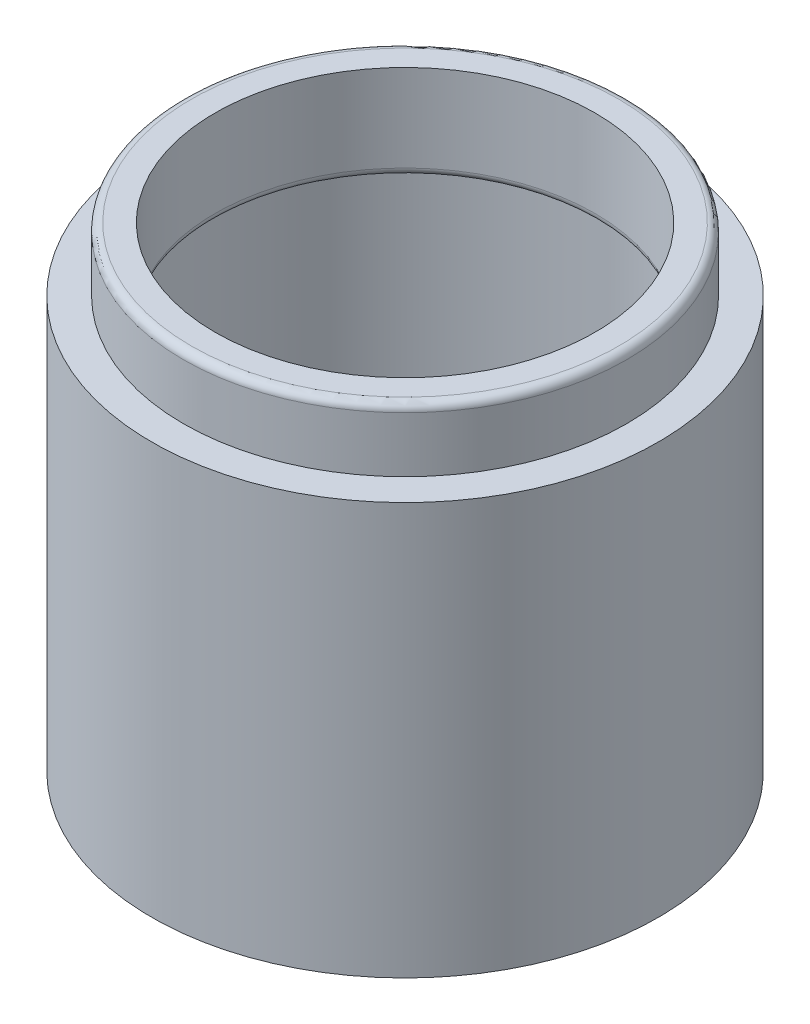
ISO-10303-21;
HEADER;
FILE_DESCRIPTION(('STEP AP214'),'2;1');
FILE_NAME('part.step','',(''),(''),'','','');
FILE_SCHEMA(('AUTOMOTIVE_DESIGN { 1 0 10303 214 1 1 1 1 }'));
ENDSEC;
DATA;
#1=APPLICATION_CONTEXT('core data for automotive mechanical design processes');
#2=APPLICATION_PROTOCOL_DEFINITION('international standard','automotive_design',2000,#1);
#3=PRODUCT_CONTEXT('',#1,'mechanical');
#4=PRODUCT('Part','Part','',(#3));
#5=PRODUCT_RELATED_PRODUCT_CATEGORY('part','',(#4));
#6=PRODUCT_DEFINITION_FORMATION('','',#4);
#7=PRODUCT_DEFINITION_CONTEXT('part definition',#1,'design');
#8=PRODUCT_DEFINITION('design','',#6,#7);
#9=PRODUCT_DEFINITION_SHAPE('','',#8);
#10=(LENGTH_UNIT() NAMED_UNIT(*) SI_UNIT(.MILLI.,.METRE.));
#11=(NAMED_UNIT(*) PLANE_ANGLE_UNIT() SI_UNIT($,.RADIAN.));
#12=(NAMED_UNIT(*) SI_UNIT($,.STERADIAN.) SOLID_ANGLE_UNIT());
#13=UNCERTAINTY_MEASURE_WITH_UNIT(LENGTH_MEASURE(1.E-05),#10,'distance_accuracy_value','');
#14=(GEOMETRIC_REPRESENTATION_CONTEXT(3) GLOBAL_UNCERTAINTY_ASSIGNED_CONTEXT((#13)) GLOBAL_UNIT_ASSIGNED_CONTEXT((#10,
#11,#12)) REPRESENTATION_CONTEXT('',''));
#15=CARTESIAN_POINT('',(0.,0.,0.));
#16=DIRECTION('',(0.,0.,1.));
#17=DIRECTION('',(1.,0.,0.));
#18=AXIS2_PLACEMENT_3D('',#15,#16,#17);
#19=CARTESIAN_POINT('',(0.,23.8125,-19.05));
#20=DIRECTION('',(0.,1.,0.));
#21=DIRECTION('',(0.,0.,1.));
#22=AXIS2_PLACEMENT_3D('',#19,#20,#21);
#23=PLANE('',#22);
#24=CARTESIAN_POINT('',(0.,23.8125,0.));
#25=DIRECTION('',(0.,1.,0.));
#26=DIRECTION('',(0.,0.,1.));
#27=AXIS2_PLACEMENT_3D('',#24,#25,#26);
#28=CIRCLE('',#27,21.43125);
#29=CARTESIAN_POINT('',(0.,23.8125,21.43125));
#30=VERTEX_POINT('',#29);
#31=EDGE_CURVE('E212',#30,#30,#28,.T.);
#32=ORIENTED_EDGE('',*,*,#31,.T.);
#33=EDGE_LOOP('',(#32));
#34=FACE_BOUND('',#33,.T.);
#35=CARTESIAN_POINT('',(0.,23.8125,0.));
#36=DIRECTION('',(0.,-1.,0.));
#37=DIRECTION('',(0.,0.,-1.));
#38=AXIS2_PLACEMENT_3D('',#35,#36,#37);
#39=CIRCLE('',#38,19.05);
#40=CARTESIAN_POINT('',(0.,23.8125,-19.05));
#41=VERTEX_POINT('',#40);
#42=EDGE_CURVE('E172',#41,#41,#39,.T.);
#43=ORIENTED_EDGE('',*,*,#42,.T.);
#44=EDGE_LOOP('',(#43));
#45=FACE_BOUND('',#44,.T.);
#46=ADVANCED_FACE('F35',(#34,#45),#23,.T.);
#47=CARTESIAN_POINT('',(0.,-32.3252119356495,0.));
#48=DIRECTION('',(0.,-1.,0.));
#49=DIRECTION('',(0.,0.,-1.));
#50=AXIS2_PLACEMENT_3D('',#47,#48,#49);
#51=CYLINDRICAL_SURFACE('',#50,22.225);
#52=CARTESIAN_POINT('',(0.,23.01875,0.));
#53=DIRECTION('',(0.,1.,0.));
#54=DIRECTION('',(0.,0.,1.));
#55=AXIS2_PLACEMENT_3D('',#52,#53,#54);
#56=CIRCLE('',#55,22.225);
#57=CARTESIAN_POINT('',(0.,23.01875,22.225));
#58=VERTEX_POINT('',#57);
#59=EDGE_CURVE('E209',#58,#58,#56,.F.);
#60=ORIENTED_EDGE('',*,*,#59,.T.);
#61=EDGE_LOOP('',(#60));
#62=FACE_BOUND('',#61,.T.);
#63=CARTESIAN_POINT('',(0.,17.4625,0.));
#64=DIRECTION('',(0.,-1.,0.));
#65=DIRECTION('',(0.,0.,-1.));
#66=AXIS2_PLACEMENT_3D('',#63,#64,#65);
#67=CIRCLE('',#66,22.225);
#68=CARTESIAN_POINT('',(0.,17.4625,-22.225));
#69=VERTEX_POINT('',#68);
#70=EDGE_CURVE('E188',#69,#69,#67,.T.);
#71=ORIENTED_EDGE('',*,*,#70,.F.);
#72=EDGE_LOOP('',(#71));
#73=FACE_BOUND('',#72,.T.);
#74=ADVANCED_FACE('F257',(#62,#73),#51,.T.);
#75=CARTESIAN_POINT('',(0.,17.4625,-22.225));
#76=DIRECTION('',(0.,1.,0.));
#77=DIRECTION('',(0.,0.,1.));
#78=AXIS2_PLACEMENT_3D('',#75,#76,#77);
#79=PLANE('',#78);
#80=ORIENTED_EDGE('',*,*,#70,.T.);
#81=EDGE_LOOP('',(#80));
#82=FACE_BOUND('',#81,.T.);
#83=CARTESIAN_POINT('',(0.,17.4625,0.));
#84=DIRECTION('',(0.,-1.,0.));
#85=DIRECTION('',(0.,0.,-1.));
#86=AXIS2_PLACEMENT_3D('',#83,#84,#85);
#87=CIRCLE('',#86,25.4);
#88=CARTESIAN_POINT('',(0.,17.4625,-25.4));
#89=VERTEX_POINT('',#88);
#90=EDGE_CURVE('E185',#89,#89,#87,.T.);
#91=ORIENTED_EDGE('',*,*,#90,.F.);
#92=EDGE_LOOP('',(#91));
#93=FACE_BOUND('',#92,.T.);
#94=ADVANCED_FACE('F262',(#82,#93),#79,.T.);
#95=CARTESIAN_POINT('',(0.,-32.3252119356495,0.));
#96=DIRECTION('',(0.,-1.,0.));
#97=DIRECTION('',(0.,0.,-1.));
#98=AXIS2_PLACEMENT_3D('',#95,#96,#97);
#99=CYLINDRICAL_SURFACE('',#98,25.4);
#100=ORIENTED_EDGE('',*,*,#90,.T.);
#101=EDGE_LOOP('',(#100));
#102=FACE_BOUND('',#101,.T.);
#103=CARTESIAN_POINT('',(0.,-23.8125,0.));
#104=DIRECTION('',(0.,-1.,0.));
#105=DIRECTION('',(0.,0.,-1.));
#106=AXIS2_PLACEMENT_3D('',#103,#104,#105);
#107=CIRCLE('',#106,25.4);
#108=CARTESIAN_POINT('',(0.,-23.8125,-25.4));
#109=VERTEX_POINT('',#108);
#110=EDGE_CURVE('E182',#109,#109,#107,.T.);
#111=ORIENTED_EDGE('',*,*,#110,.F.);
#112=EDGE_LOOP('',(#111));
#113=FACE_BOUND('',#112,.T.);
#114=ADVANCED_FACE('F298',(#102,#113),#99,.T.);
#115=CARTESIAN_POINT('',(0.,-23.8125,-25.4));
#116=DIRECTION('',(0.,-1.,0.));
#117=DIRECTION('',(0.,0.,-1.));
#118=AXIS2_PLACEMENT_3D('',#115,#116,#117);
#119=PLANE('',#118);
#120=CARTESIAN_POINT('',(0.,-23.8125,0.));
#121=DIRECTION('',(0.,-1.,0.));
#122=DIRECTION('',(0.,0.,-1.));
#123=AXIS2_PLACEMENT_3D('',#120,#121,#122);
#124=CIRCLE('',#123,23.01875);
#125=CARTESIAN_POINT('',(0.,-23.8125,-23.01875));
#126=VERTEX_POINT('',#125);
#127=EDGE_CURVE('E206',#126,#126,#124,.F.);
#128=ORIENTED_EDGE('',*,*,#127,.T.);
#129=EDGE_LOOP('',(#128));
#130=FACE_BOUND('',#129,.T.);
#131=ORIENTED_EDGE('',*,*,#110,.T.);
#132=EDGE_LOOP('',(#131));
#133=FACE_BOUND('',#132,.T.);
#134=ADVANCED_FACE('F294',(#130,#133),#119,.T.);
#135=CARTESIAN_POINT('',(0.,-32.3252119356495,0.));
#136=DIRECTION('',(0.,-1.,0.));
#137=DIRECTION('',(0.,0.,-1.));
#138=AXIS2_PLACEMENT_3D('',#135,#136,#137);
#139=CYLINDRICAL_SURFACE('',#138,22.225);
#140=CARTESIAN_POINT('',(0.,-18.25625,0.));
#141=DIRECTION('',(0.,-1.,0.));
#142=DIRECTION('',(0.,0.,-1.));
#143=AXIS2_PLACEMENT_3D('',#140,#141,#142);
#144=CIRCLE('',#143,22.225);
#145=CARTESIAN_POINT('',(0.,-18.25625,-22.225));
#146=VERTEX_POINT('',#145);
#147=EDGE_CURVE('E203',#146,#146,#144,.F.);
#148=ORIENTED_EDGE('',*,*,#147,.T.);
#149=EDGE_LOOP('',(#148));
#150=FACE_BOUND('',#149,.T.);
#151=CARTESIAN_POINT('',(0.,-23.01875,0.));
#152=DIRECTION('',(0.,-1.,0.));
#153=DIRECTION('',(0.,0.,-1.));
#154=AXIS2_PLACEMENT_3D('',#151,#152,#153);
#155=CIRCLE('',#154,22.225);
#156=CARTESIAN_POINT('',(0.,-23.01875,-22.225));
#157=VERTEX_POINT('',#156);
#158=EDGE_CURVE('E111',#157,#157,#155,.T.);
#159=ORIENTED_EDGE('',*,*,#158,.T.);
#160=EDGE_LOOP('',(#159));
#161=FACE_BOUND('',#160,.T.);
#162=ADVANCED_FACE('F291',(#150,#161),#139,.F.);
#163=CARTESIAN_POINT('',(0.,-17.4625,-22.225));
#164=DIRECTION('',(0.,-1.,0.));
#165=DIRECTION('',(0.,0.,-1.));
#166=AXIS2_PLACEMENT_3D('',#163,#164,#165);
#167=PLANE('',#166);
#168=DIRECTION('',(0.,0.,-1.));
#169=VECTOR('',#168,1.);
#170=CARTESIAN_POINT('',(3.175,-17.4625,0.));
#171=LINE('',#170,#169);
#172=CARTESIAN_POINT('',(3.175,-17.4625,-1.5875));
#173=VERTEX_POINT('',#172);
#174=CARTESIAN_POINT('',(3.175,-17.4625,-9.81814527100206));
#175=VERTEX_POINT('',#174);
#176=EDGE_CURVE('E124',#173,#175,#171,.T.);
#177=ORIENTED_EDGE('',*,*,#176,.F.);
#178=CARTESIAN_POINT('',(1.5875,-17.4625,-1.5875));
#179=DIRECTION('',(0.,-1.,0.));
#180=DIRECTION('',(0.,0.,-1.));
#181=AXIS2_PLACEMENT_3D('',#178,#179,#180);
#182=CIRCLE('',#181,1.5875);
#183=CARTESIAN_POINT('',(1.5875,-17.4625,0.));
#184=VERTEX_POINT('',#183);
#185=EDGE_CURVE('E43',#173,#184,#182,.T.);
#186=ORIENTED_EDGE('',*,*,#185,.T.);
#187=DIRECTION('',(1.,0.,0.));
#188=VECTOR('',#187,1.);
#189=CARTESIAN_POINT('',(-3.175,-17.4625,0.));
#190=LINE('',#189,#188);
#191=CARTESIAN_POINT('',(-1.5875,-17.4625,0.));
#192=VERTEX_POINT('',#191);
#193=EDGE_CURVE('E126',#192,#184,#190,.T.);
#194=ORIENTED_EDGE('',*,*,#193,.F.);
#195=CARTESIAN_POINT('',(-1.5875,-17.4625,-1.5875));
#196=DIRECTION('',(0.,-1.,0.));
#197=DIRECTION('',(0.,0.,-1.));
#198=AXIS2_PLACEMENT_3D('',#195,#196,#197);
#199=CIRCLE('',#198,1.5875);
#200=CARTESIAN_POINT('',(-3.175,-17.4625,-1.5875));
#201=VERTEX_POINT('',#200);
#202=EDGE_CURVE('E50',#192,#201,#199,.T.);
#203=ORIENTED_EDGE('',*,*,#202,.T.);
#204=DIRECTION('',(0.,0.,1.));
#205=VECTOR('',#204,1.);
#206=CARTESIAN_POINT('',(-3.175,-17.4625,0.));
#207=LINE('',#206,#205);
#208=CARTESIAN_POINT('',(-3.175,-17.4625,-9.81814527100196));
#209=VERTEX_POINT('',#208);
#210=EDGE_CURVE('E117',#209,#201,#207,.T.);
#211=ORIENTED_EDGE('',*,*,#210,.F.);
#212=CARTESIAN_POINT('',(0.,-17.4625,0.));
#213=DIRECTION('',(0.,-1.,0.));
#214=DIRECTION('',(0.,0.,-1.));
#215=AXIS2_PLACEMENT_3D('',#212,#213,#214);
#216=CIRCLE('',#215,10.31875);
#217=EDGE_CURVE('E103',#209,#175,#216,.F.);
#218=ORIENTED_EDGE('',*,*,#217,.T.);
#219=EDGE_LOOP('',(#177,#186,#194,#203,#211,#218));
#220=FACE_BOUND('',#219,.T.);
#221=CARTESIAN_POINT('',(0.,-17.4625,0.));
#222=DIRECTION('',(0.,-1.,0.));
#223=DIRECTION('',(0.,0.,-1.));
#224=AXIS2_PLACEMENT_3D('',#221,#222,#223);
#225=CIRCLE('',#224,21.43125);
#226=CARTESIAN_POINT('',(0.,-17.4625,-21.43125));
#227=VERTEX_POINT('',#226);
#228=EDGE_CURVE('E112',#227,#227,#225,.T.);
#229=ORIENTED_EDGE('',*,*,#228,.T.);
#230=EDGE_LOOP('',(#229));
#231=FACE_BOUND('',#230,.T.);
#232=ADVANCED_FACE('F122',(#220,#231),#167,.T.);
#233=CARTESIAN_POINT('',(0.,-32.3252119356495,0.));
#234=DIRECTION('',(0.,-1.,0.));
#235=DIRECTION('',(0.,0.,-1.));
#236=AXIS2_PLACEMENT_3D('',#233,#234,#235);
#237=CYLINDRICAL_SURFACE('',#236,9.525);
#238=DIRECTION('',(0.,-1.,0.));
#239=VECTOR('',#238,1.);
#240=CARTESIAN_POINT('',(3.175,-32.3252119356495,-8.98025612106916));
#241=LINE('',#240,#239);
#242=CARTESIAN_POINT('',(3.175,-16.66875,-8.98025612106916));
#243=VERTEX_POINT('',#242);
#244=CARTESIAN_POINT('',(3.175,-15.08125,-8.98025612106916));
#245=VERTEX_POINT('',#244);
#246=EDGE_CURVE('E173',#243,#245,#241,.F.);
#247=ORIENTED_EDGE('',*,*,#246,.F.);
#248=CARTESIAN_POINT('',(0.,-16.66875,0.));
#249=DIRECTION('',(0.,-1.,0.));
#250=DIRECTION('',(0.,0.,-1.));
#251=AXIS2_PLACEMENT_3D('',#248,#249,#250);
#252=CIRCLE('',#251,9.525);
#253=CARTESIAN_POINT('',(-3.175,-16.66875,-8.98025612106916));
#254=VERTEX_POINT('',#253);
#255=EDGE_CURVE('E194',#243,#254,#252,.T.);
#256=ORIENTED_EDGE('',*,*,#255,.T.);
#257=DIRECTION('',(0.,-1.,0.));
#258=VECTOR('',#257,1.);
#259=CARTESIAN_POINT('',(-3.175,-32.3252119356495,-8.98025612106916));
#260=LINE('',#259,#258);
#261=CARTESIAN_POINT('',(-3.175,-15.08125,-8.98025612106916));
#262=VERTEX_POINT('',#261);
#263=EDGE_CURVE('E120',#262,#254,#260,.T.);
#264=ORIENTED_EDGE('',*,*,#263,.F.);
#265=CARTESIAN_POINT('',(0.,-15.08125,0.));
#266=DIRECTION('',(0.,1.,0.));
#267=DIRECTION('',(0.,0.,1.));
#268=AXIS2_PLACEMENT_3D('',#265,#266,#267);
#269=CIRCLE('',#268,9.525);
#270=EDGE_CURVE('E196',#262,#245,#269,.T.);
#271=ORIENTED_EDGE('',*,*,#270,.T.);
#272=EDGE_LOOP('',(#247,#256,#264,#271));
#273=FACE_BOUND('',#272,.T.);
#274=ADVANCED_FACE('F284',(#273),#237,.F.);
#275=CARTESIAN_POINT('',(0.,-14.2875,-9.525));
#276=DIRECTION('',(0.,1.,0.));
#277=DIRECTION('',(0.,0.,1.));
#278=AXIS2_PLACEMENT_3D('',#275,#276,#277);
#279=PLANE('',#278);
#280=CARTESIAN_POINT('',(0.,-14.2875,0.));
#281=DIRECTION('',(0.,-1.,0.));
#282=DIRECTION('',(0.,0.,-1.));
#283=AXIS2_PLACEMENT_3D('',#280,#281,#282);
#284=CIRCLE('',#283,22.4);
#285=CARTESIAN_POINT('',(0.,-14.2875,-22.4));
#286=VERTEX_POINT('',#285);
#287=EDGE_CURVE('E179',#286,#286,#284,.T.);
#288=ORIENTED_EDGE('',*,*,#287,.F.);
#289=EDGE_LOOP('',(#288));
#290=FACE_BOUND('',#289,.T.);
#291=DIRECTION('',(1.,0.,0.));
#292=VECTOR('',#291,1.);
#293=CARTESIAN_POINT('',(-3.175,-14.2875,0.));
#294=LINE('',#293,#292);
#295=CARTESIAN_POINT('',(-1.5875,-14.2875,0.));
#296=VERTEX_POINT('',#295);
#297=CARTESIAN_POINT('',(1.5875,-14.2875,0.));
#298=VERTEX_POINT('',#297);
#299=EDGE_CURVE('E244',#296,#298,#294,.T.);
#300=ORIENTED_EDGE('',*,*,#299,.T.);
#301=CARTESIAN_POINT('',(1.5875,-14.2875,-1.5875));
#302=DIRECTION('',(0.,1.,0.));
#303=DIRECTION('',(0.,0.,1.));
#304=AXIS2_PLACEMENT_3D('',#301,#302,#303);
#305=CIRCLE('',#304,1.5875);
#306=CARTESIAN_POINT('',(3.175,-14.2875,-1.5875));
#307=VERTEX_POINT('',#306);
#308=EDGE_CURVE('E228',#298,#307,#305,.T.);
#309=ORIENTED_EDGE('',*,*,#308,.T.);
#310=DIRECTION('',(0.,0.,-1.));
#311=VECTOR('',#310,1.);
#312=CARTESIAN_POINT('',(3.175,-14.2875,0.));
#313=LINE('',#312,#311);
#314=CARTESIAN_POINT('',(3.175,-14.2875,-9.81814527100206));
#315=VERTEX_POINT('',#314);
#316=EDGE_CURVE('E240',#307,#315,#313,.T.);
#317=ORIENTED_EDGE('',*,*,#316,.T.);
#318=CARTESIAN_POINT('',(0.,-14.2875,0.));
#319=DIRECTION('',(0.,1.,0.));
#320=DIRECTION('',(0.,0.,1.));
#321=AXIS2_PLACEMENT_3D('',#318,#319,#320);
#322=CIRCLE('',#321,10.31875);
#323=CARTESIAN_POINT('',(-3.175,-14.2875,-9.81814527100206));
#324=VERTEX_POINT('',#323);
#325=EDGE_CURVE('E191',#315,#324,#322,.F.);
#326=ORIENTED_EDGE('',*,*,#325,.T.);
#327=DIRECTION('',(0.,0.,1.));
#328=VECTOR('',#327,1.);
#329=CARTESIAN_POINT('',(-3.175,-14.2875,0.));
#330=LINE('',#329,#328);
#331=CARTESIAN_POINT('',(-3.175,-14.2875,-1.5875));
#332=VERTEX_POINT('',#331);
#333=EDGE_CURVE('E247',#324,#332,#330,.T.);
#334=ORIENTED_EDGE('',*,*,#333,.T.);
#335=CARTESIAN_POINT('',(-1.5875,-14.2875,-1.5875));
#336=DIRECTION('',(0.,1.,0.));
#337=DIRECTION('',(0.,0.,1.));
#338=AXIS2_PLACEMENT_3D('',#335,#336,#337);
#339=CIRCLE('',#338,1.5875);
#340=EDGE_CURVE('E226',#332,#296,#339,.T.);
#341=ORIENTED_EDGE('',*,*,#340,.T.);
#342=EDGE_LOOP('',(#300,#309,#317,#326,#334,#341));
#343=FACE_BOUND('',#342,.T.);
#344=ADVANCED_FACE('F242',(#290,#343),#279,.T.);
#345=CARTESIAN_POINT('',(0.,-32.3252119356495,0.));
#346=DIRECTION('',(0.,-1.,0.));
#347=DIRECTION('',(0.,0.,-1.));
#348=AXIS2_PLACEMENT_3D('',#345,#346,#347);
#349=CYLINDRICAL_SURFACE('',#348,22.4);
#350=ORIENTED_EDGE('',*,*,#287,.T.);
#351=EDGE_LOOP('',(#350));
#352=FACE_BOUND('',#351,.T.);
#353=CARTESIAN_POINT('',(0.,14.2875,0.));
#354=DIRECTION('',(0.,-1.,0.));
#355=DIRECTION('',(0.,0.,-1.));
#356=AXIS2_PLACEMENT_3D('',#353,#354,#355);
#357=CIRCLE('',#356,22.4);
#358=CARTESIAN_POINT('',(0.,14.2875,-22.4));
#359=VERTEX_POINT('',#358);
#360=EDGE_CURVE('E176',#359,#359,#357,.T.);
#361=ORIENTED_EDGE('',*,*,#360,.F.);
#362=EDGE_LOOP('',(#361));
#363=FACE_BOUND('',#362,.T.);
#364=ADVANCED_FACE('F275',(#352,#363),#349,.F.);
#365=CARTESIAN_POINT('',(0.,14.2875,-22.4));
#366=DIRECTION('',(0.,-1.,0.));
#367=DIRECTION('',(0.,0.,-1.));
#368=AXIS2_PLACEMENT_3D('',#365,#366,#367);
#369=PLANE('',#368);
#370=CARTESIAN_POINT('',(0.,14.2875,0.));
#371=DIRECTION('',(0.,-1.,0.));
#372=DIRECTION('',(0.,0.,-1.));
#373=AXIS2_PLACEMENT_3D('',#370,#371,#372);
#374=CIRCLE('',#373,19.84375);
#375=CARTESIAN_POINT('',(0.,14.2875,-19.84375));
#376=VERTEX_POINT('',#375);
#377=EDGE_CURVE('E218',#376,#376,#374,.F.);
#378=ORIENTED_EDGE('',*,*,#377,.T.);
#379=EDGE_LOOP('',(#378));
#380=FACE_BOUND('',#379,.T.);
#381=ORIENTED_EDGE('',*,*,#360,.T.);
#382=EDGE_LOOP('',(#381));
#383=FACE_BOUND('',#382,.T.);
#384=ADVANCED_FACE('F269',(#380,#383),#369,.T.);
#385=CARTESIAN_POINT('',(0.,-32.3252119356495,0.));
#386=DIRECTION('',(0.,-1.,0.));
#387=DIRECTION('',(0.,0.,-1.));
#388=AXIS2_PLACEMENT_3D('',#385,#386,#387);
#389=CYLINDRICAL_SURFACE('',#388,19.05);
#390=CARTESIAN_POINT('',(0.,15.08125,0.));
#391=DIRECTION('',(0.,-1.,0.));
#392=DIRECTION('',(0.,0.,-1.));
#393=AXIS2_PLACEMENT_3D('',#390,#391,#392);
#394=CIRCLE('',#393,19.05);
#395=CARTESIAN_POINT('',(0.,15.08125,-19.05));
#396=VERTEX_POINT('',#395);
#397=EDGE_CURVE('E215',#396,#396,#394,.T.);
#398=ORIENTED_EDGE('',*,*,#397,.T.);
#399=EDGE_LOOP('',(#398));
#400=FACE_BOUND('',#399,.T.);
#401=ORIENTED_EDGE('',*,*,#42,.F.);
#402=EDGE_LOOP('',(#401));
#403=FACE_BOUND('',#402,.T.);
#404=ADVANCED_FACE('F161',(#400,#403),#389,.F.);
#405=CARTESIAN_POINT('',(0.,-15.08125,0.));
#406=DIRECTION('',(0.,1.,0.));
#407=DIRECTION('',(0.,0.,1.));
#408=AXIS2_PLACEMENT_3D('',#405,#406,#407);
#409=TOROIDAL_SURFACE('',#408,10.31875,0.79375);
#410=CARTESIAN_POINT('',(3.175,-14.3472202190547,-10.1351343551443));
#411=CARTESIAN_POINT('',(3.175,-14.3641884761098,-10.1783404791717));
#412=CARTESIAN_POINT('',(3.175,-14.3847007952145,-10.2201839262232));
#413=CARTESIAN_POINT('',(3.175,-14.4324039625409,-10.2999176866204));
#414=CARTESIAN_POINT('',(3.175,-14.4596003953349,-10.337804656421));
#415=CARTESIAN_POINT('',(3.175,-14.5200846076736,-10.4084698743429));
#416=CARTESIAN_POINT('',(3.175,-14.5533810249313,-10.4412407545243));
#417=CARTESIAN_POINT('',(3.175,-14.6251666062533,-10.5004856165145));
#418=CARTESIAN_POINT('',(3.175,-14.66365410763,-10.5269616070852));
#419=CARTESIAN_POINT('',(3.175,-14.7433781350827,-10.5719072124016));
#420=CARTESIAN_POINT('',(3.175,-14.7844816421669,-10.5906126642873));
#421=CARTESIAN_POINT('',(3.175,-14.869321680799,-10.6205687417075));
#422=CARTESIAN_POINT('',(3.175,-14.913057700778,-10.6318208105676));
#423=CARTESIAN_POINT('',(3.175,-15.0002557901359,-10.6461915649335));
#424=CARTESIAN_POINT('',(3.175,-15.0436730084606,-10.6495833964399));
#425=CARTESIAN_POINT('',(3.175,-15.1304477516349,-10.6489197056482));
#426=CARTESIAN_POINT('',(3.175,-15.1738052827076,-10.6448650296412));
#427=CARTESIAN_POINT('',(3.175,-15.2586232325778,-10.6295591220843));
#428=CARTESIAN_POINT('',(3.175,-15.3001013203365,-10.6184053805981));
#429=CARTESIAN_POINT('',(3.175,-15.3806295217462,-10.5893741602056));
#430=CARTESIAN_POINT('',(3.175,-15.419679572057,-10.5714965059778));
#431=CARTESIAN_POINT('',(3.175,-15.4947846769198,-10.5293452970209));
#432=CARTESIAN_POINT('',(3.175,-15.5307973018671,-10.5049962548213));
#433=CARTESIAN_POINT('',(3.175,-15.5983899678876,-10.4507783558096));
#434=CARTESIAN_POINT('',(3.175,-15.6299694052391,-10.4209087484746));
#435=CARTESIAN_POINT('',(3.175,-15.6889359125982,-10.3554646917385));
#436=CARTESIAN_POINT('',(3.175,-15.7161495881476,-10.3197341206863));
#437=CARTESIAN_POINT('',(3.175,-15.7644831087355,-10.2443683280363));
#438=CARTESIAN_POINT('',(3.175,-15.7856017378227,-10.2047323294253));
#439=CARTESIAN_POINT('',(3.175,-15.8221039010277,-10.1208601015544));
#440=CARTESIAN_POINT('',(3.175,-15.8372011197036,-10.0764992458351));
#441=CARTESIAN_POINT('',(3.175,-15.8600394058654,-9.98592288181528));
#442=CARTESIAN_POINT('',(3.175,-15.8677789286492,-9.93970698618254));
#443=CARTESIAN_POINT('',(3.175,-15.8759360800933,-9.84485865545865));
#444=CARTESIAN_POINT('',(3.175,-15.8760640802305,-9.79620115822899));
#445=CARTESIAN_POINT('',(3.175,-15.8682959388885,-9.69952658670286));
#446=CARTESIAN_POINT('',(3.175,-15.8603986097952,-9.65150960825791));
#447=CARTESIAN_POINT('',(3.175,-15.83656239446,-9.55665921778529));
#448=CARTESIAN_POINT('',(3.175,-15.8204922900911,-9.50985865041477));
#449=CARTESIAN_POINT('',(3.175,-15.7805968328911,-9.4196796132177));
#450=CARTESIAN_POINT('',(3.175,-15.7567716387623,-9.37630107338436));
#451=CARTESIAN_POINT('',(3.175,-15.702368516292,-9.2950359545505));
#452=CARTESIAN_POINT('',(3.175,-15.6719088596601,-9.25707037144724));
#453=CARTESIAN_POINT('',(3.175,-15.6047629663526,-9.18710645734883));
#454=CARTESIAN_POINT('',(3.175,-15.5680784363573,-9.15510649578593));
#455=CARTESIAN_POINT('',(3.175,-15.4913475782646,-9.09964304047928));
#456=CARTESIAN_POINT('',(3.175,-15.4515405160658,-9.07584883786387));
#457=CARTESIAN_POINT('',(3.175,-15.3683225409993,-9.03573554908151));
#458=CARTESIAN_POINT('',(3.175,-15.3249130161717,-9.01941359948367));
#459=CARTESIAN_POINT('',(3.175,-15.2383062309513,-8.99561312939194));
#460=CARTESIAN_POINT('',(3.175,-15.1952289403949,-8.98769708401243));
#461=CARTESIAN_POINT('',(3.175,-15.1083571756299,-8.97947788855926));
#462=CARTESIAN_POINT('',(3.175,-15.0645628690934,-8.97917298338511));
#463=CARTESIAN_POINT('',(3.175,-14.9789999211958,-8.98607091736646));
#464=CARTESIAN_POINT('',(3.175,-14.9372115003869,-8.99303195415342));
#465=CARTESIAN_POINT('',(3.175,-14.8553841992108,-9.01382154934693));
#466=CARTESIAN_POINT('',(3.175,-14.8153453181878,-9.0276501051789));
#467=CARTESIAN_POINT('',(3.175,-14.737783198046,-9.06180180634892));
#468=CARTESIAN_POINT('',(3.175,-14.7002814825328,-9.08217369696922));
#469=CARTESIAN_POINT('',(3.175,-14.6290494392956,-9.12868525308547));
#470=CARTESIAN_POINT('',(3.175,-14.5953197578809,-9.1548259047399));
#471=CARTESIAN_POINT('',(3.175,-14.5310738844386,-9.21325614561539));
#472=CARTESIAN_POINT('',(3.175,-14.5007487946151,-9.24575566418548));
#473=CARTESIAN_POINT('',(3.175,-14.4456489446401,-9.31515574129137));
#474=CARTESIAN_POINT('',(3.175,-14.4208753533921,-9.3520572241873));
#475=CARTESIAN_POINT('',(3.175,-14.3761880748018,-9.43133869135893));
#476=CARTESIAN_POINT('',(3.175,-14.3566077181026,-9.47390664234936));
#477=CARTESIAN_POINT('',(3.175,-14.3245377595608,-9.56164761457306));
#478=CARTESIAN_POINT('',(3.175,-14.3120514768893,-9.6068218443601));
#479=CARTESIAN_POINT('',(3.175,-14.2940556994414,-9.70052655924136));
#480=CARTESIAN_POINT('',(3.175,-14.2888640180762,-9.74911816355577));
#481=CARTESIAN_POINT('',(3.175,-14.2866086797048,-9.84645568809413));
#482=CARTESIAN_POINT('',(3.175,-14.2895368605801,-9.89520140419227));
#483=CARTESIAN_POINT('',(3.175,-14.3012449152217,-9.97614133764718));
#484=CARTESIAN_POINT('',(3.175,-14.3078643420888,-10.0086630058146));
#485=CARTESIAN_POINT('',(3.175,-14.3247935288698,-10.0727328533946));
#486=CARTESIAN_POINT('',(3.175,-14.3351032570666,-10.1042810411714));
#487=CARTESIAN_POINT('',(3.175,-14.3472202190547,-10.1351343551443));
#488=B_SPLINE_CURVE_WITH_KNOTS('',3,(#410,#411,#412,#413,#414,#415,#416,#417,#418,#419,#420,
#421,#422,#423,#424,#425,#426,#427,#428,#429,#430,#431,#432,#433,#434,#435,#436,#437,#438,#439,
#440,#441,#442,#443,#444,#445,#446,#447,#448,#449,#450,#451,#452,#453,#454,#455,#456,#457,#458,
#459,#460,#461,#462,#463,#464,#465,#466,#467,#468,#469,#470,#471,#472,#473,#474,#475,#476,#477,
#478,#479,#480,#481,#482,#483,#484,#485,#486,#487),.UNSPECIFIED.,.T.,.F.,(4,2,2,2,2,2,2,2,2,2,2,
2,2,2,2,2,2,2,2,2,2,2,2,2,2,2,2,2,2,2,2,2,2,2,2,2,2,2,4),(0.,0.1391414920998,0.278399634395359,
0.41785651524641,0.557268834112181,0.69207031746198,0.826845689267628,0.956862413209713,
1.08686436174444,1.2151184444267,1.34337587147782,1.47320058723663,1.60304296571202,
1.73718371281563,1.87135120229769,2.01129958220894,2.15127733692111,2.29657815130118,
2.44190047089755,2.58963335640551,2.73736321885564,2.88264838366445,3.0278937796499,
3.16630783855661,3.30466881152897,3.4354099138159,3.5661208674144,3.69261648467598,
3.81911205451547,3.94657271750877,4.0740551865565,4.20682078608869,4.33961431405652,
4.4795549946932,4.6195610968848,4.76549562131514,4.91128350495859,5.01064472134721,
5.11000508377375),.UNSPECIFIED.);
#489=EDGE_CURVE('E166',#245,#315,#488,.T.);
#490=ORIENTED_EDGE('',*,*,#489,.F.);
#491=ORIENTED_EDGE('',*,*,#270,.F.);
#492=CARTESIAN_POINT('',(-3.175,-14.3472202190547,-10.1351343551443));
#493=CARTESIAN_POINT('',(-3.175,-14.3293813161983,-10.0897008952481));
#494=CARTESIAN_POINT('',(-3.175,-14.3154356914397,-10.0426918655474));
#495=CARTESIAN_POINT('',(-3.175,-14.2956356285394,-9.94694904970529));
#496=CARTESIAN_POINT('',(-3.175,-14.2897947946628,-9.89821250409831));
#497=CARTESIAN_POINT('',(-3.175,-14.2863171906824,-9.8005058615557));
#498=CARTESIAN_POINT('',(-3.175,-14.2886700544965,-9.75153613793377));
#499=CARTESIAN_POINT('',(-3.175,-14.3014785029812,-9.65468433040408));
#500=CARTESIAN_POINT('',(-3.175,-14.3119315679971,-9.60680191304448));
#501=CARTESIAN_POINT('',(-3.175,-14.3408365868204,-9.51302493169912));
#502=CARTESIAN_POINT('',(-3.175,-14.3593611972033,-9.46715269092748));
#503=CARTESIAN_POINT('',(-3.175,-14.4040156195626,-9.3792587579745));
#504=CARTESIAN_POINT('',(-3.175,-14.4301455168003,-9.3372371089682));
#505=CARTESIAN_POINT('',(-3.175,-14.4887406685138,-9.25930392409531));
#506=CARTESIAN_POINT('',(-3.175,-14.521053837767,-9.22327826978344));
#507=CARTESIAN_POINT('',(-3.175,-14.5915541649176,-9.15751678032723));
#508=CARTESIAN_POINT('',(-3.175,-14.6297394798424,-9.12777897867138));
#509=CARTESIAN_POINT('',(-3.175,-14.708858807789,-9.07707251436245));
#510=CARTESIAN_POINT('',(-3.175,-14.7495585335941,-9.05573851632679));
#511=CARTESIAN_POINT('',(-3.175,-14.8341041385221,-9.02065240992559));
#512=CARTESIAN_POINT('',(-3.175,-14.8779488271796,-9.00689744959894));
#513=CARTESIAN_POINT('',(-3.175,-14.9650081376549,-8.98807257706729));
#514=CARTESIAN_POINT('',(-3.175,-15.0081312040744,-8.98257779458228));
#515=CARTESIAN_POINT('',(-3.175,-15.0946746773702,-8.97912527156435));
#516=CARTESIAN_POINT('',(-3.175,-15.1380950255141,-8.98116608283841));
#517=CARTESIAN_POINT('',(-3.175,-15.2227860210302,-8.99254411159884));
#518=CARTESIAN_POINT('',(-3.175,-15.2640831344537,-9.00168610497086));
#519=CARTESIAN_POINT('',(-3.175,-15.3445884020515,-9.02668202389192));
#520=CARTESIAN_POINT('',(-3.175,-15.3837964945276,-9.04253614755653));
#521=CARTESIAN_POINT('',(-3.175,-15.4596345485748,-9.08065685098801));
#522=CARTESIAN_POINT('',(-3.175,-15.4962213413867,-9.10300910532501));
#523=CARTESIAN_POINT('',(-3.175,-15.5653336553001,-9.15328864282374));
#524=CARTESIAN_POINT('',(-3.175,-15.5978584167262,-9.18121696628366));
#525=CARTESIAN_POINT('',(-3.175,-15.6595016799132,-9.24317187282185));
#526=CARTESIAN_POINT('',(-3.175,-15.6884010888741,-9.27741629356102));
#527=CARTESIAN_POINT('',(-3.175,-15.7403905576279,-9.3500599389522));
#528=CARTESIAN_POINT('',(-3.175,-15.7634791444592,-9.38846021353424));
#529=CARTESIAN_POINT('',(-3.175,-15.8044711492921,-9.47052922447106));
#530=CARTESIAN_POINT('',(-3.175,-15.8220303738688,-9.51437001826503));
#531=CARTESIAN_POINT('',(-3.175,-15.8498475149089,-9.60431110242869));
#532=CARTESIAN_POINT('',(-3.175,-15.8601038023269,-9.65041189447999));
#533=CARTESIAN_POINT('',(-3.175,-15.8733465913917,-9.74544513307444));
#534=CARTESIAN_POINT('',(-3.175,-15.8760410090648,-9.79441852688906));
#535=CARTESIAN_POINT('',(-3.175,-15.8732382721722,-9.89213527196235));
#536=CARTESIAN_POINT('',(-3.175,-15.8677403439292,-9.9408786010578));
#537=CARTESIAN_POINT('',(-3.175,-15.848557647359,-10.0370988016832));
#538=CARTESIAN_POINT('',(-3.175,-15.8348144288335,-10.0845640788233));
#539=CARTESIAN_POINT('',(-3.175,-15.7993579520673,-10.1764249193914));
#540=CARTESIAN_POINT('',(-3.175,-15.7776454608877,-10.2208207777694));
#541=CARTESIAN_POINT('',(-3.175,-15.7273698157739,-10.3040767589848));
#542=CARTESIAN_POINT('',(-3.175,-15.6989870668224,-10.3430456593387));
#543=CARTESIAN_POINT('',(-3.175,-15.6358123067156,-10.4153921374304));
#544=CARTESIAN_POINT('',(-3.175,-15.6010218967383,-10.4487711080377));
#545=CARTESIAN_POINT('',(-3.175,-15.5276150381134,-10.5074464334062));
#546=CARTESIAN_POINT('',(-3.175,-15.4892265793125,-10.5330279666326));
#547=CARTESIAN_POINT('',(-3.175,-15.4085526347216,-10.5770518648661));
#548=CARTESIAN_POINT('',(-3.175,-15.3662681938185,-10.5954961371978));
#549=CARTESIAN_POINT('',(-3.175,-15.280919073298,-10.62394255856));
#550=CARTESIAN_POINT('',(-3.175,-15.237961350201,-10.6342660987077));
#551=CARTESIAN_POINT('',(-3.175,-15.1509107961319,-10.6473523260093));
#552=CARTESIAN_POINT('',(-3.175,-15.1068181576544,-10.6501162869351));
#553=CARTESIAN_POINT('',(-3.175,-15.0199023334856,-10.6480107744963));
#554=CARTESIAN_POINT('',(-3.175,-14.9770745199767,-10.6433267215054));
#555=CARTESIAN_POINT('',(-3.175,-14.8928180787613,-10.6268364195072));
#556=CARTESIAN_POINT('',(-3.175,-14.85138934193,-10.6150307273329));
#557=CARTESIAN_POINT('',(-3.175,-14.7710511695188,-10.5846927011633));
#558=CARTESIAN_POINT('',(-3.175,-14.7321432145091,-10.5661564554661));
#559=CARTESIAN_POINT('',(-3.175,-14.6578801328988,-10.5229595380057));
#560=CARTESIAN_POINT('',(-3.175,-14.6225262582503,-10.4982967186547));
#561=CARTESIAN_POINT('',(-3.175,-14.5554138632638,-10.4429284908091));
#562=CARTESIAN_POINT('',(-3.175,-14.5237680357984,-10.412086793582));
#563=CARTESIAN_POINT('',(-3.175,-14.4658926410759,-10.3457323211739));
#564=CARTESIAN_POINT('',(-3.175,-14.4396574493167,-10.3102244601245));
#565=CARTESIAN_POINT('',(-3.175,-14.4027877391114,-10.251057961569));
#566=CARTESIAN_POINT('',(-3.175,-14.3901957751077,-10.2285928913381));
#567=CARTESIAN_POINT('',(-3.175,-14.3671151585472,-10.1826093368936));
#568=CARTESIAN_POINT('',(-3.175,-14.3566264594979,-10.1590908759792));
#569=CARTESIAN_POINT('',(-3.175,-14.3472202190547,-10.1351343551443));
#570=B_SPLINE_CURVE_WITH_KNOTS('',3,(#492,#493,#494,#495,#496,#497,#498,#499,#500,#501,#502,
#503,#504,#505,#506,#507,#508,#509,#510,#511,#512,#513,#514,#515,#516,#517,#518,#519,#520,#521,
#522,#523,#524,#525,#526,#527,#528,#529,#530,#531,#532,#533,#534,#535,#536,#537,#538,#539,#540,
#541,#542,#543,#544,#545,#546,#547,#548,#549,#550,#551,#552,#553,#554,#555,#556,#557,#558,#559,
#560,#561,#562,#563,#564,#565,#566,#567,#568,#569),.UNSPECIFIED.,.T.,.F.,(4,2,2,2,2,2,2,2,2,2,2,
2,2,2,2,2,2,2,2,2,2,2,2,2,2,2,2,2,2,2,2,2,2,2,2,2,2,2,4),(0.,0.146334038667546,0.29291340984727,
0.439307406661692,0.58565588432025,0.733349859620392,0.881045490747914,1.0254906243715,
1.16989051607254,1.3070399088582,1.44413765757753,1.57390846201758,1.70365432835735,
1.82995428626451,1.9562579723073,2.08430891833111,2.2123837765143,2.34622096130358,
2.48009203784443,2.62113748191129,2.76221437873689,2.90867010763781,3.05513966855196,
3.20266001592316,3.35016616783994,3.49406716465401,3.63793225144282,3.77562924044418,
3.91328940656139,4.04518067154919,4.17704971179123,4.30568690001248,4.43431403153841,
4.56301603929157,4.69176322561476,4.82374618938924,4.95559125395554,5.03275315086483,
5.10991334192691),.UNSPECIFIED.);
#571=EDGE_CURVE('E148',#324,#262,#570,.T.);
#572=ORIENTED_EDGE('',*,*,#571,.F.);
#573=ORIENTED_EDGE('',*,*,#325,.F.);
#574=EDGE_LOOP('',(#490,#491,#572,#573));
#575=FACE_BOUND('',#574,.T.);
#576=ADVANCED_FACE('F157',(#575),#409,.T.);
#577=CARTESIAN_POINT('',(0.,-16.66875,0.));
#578=DIRECTION('',(0.,-1.,0.));
#579=DIRECTION('',(0.,0.,-1.));
#580=AXIS2_PLACEMENT_3D('',#577,#578,#579);
#581=TOROIDAL_SURFACE('',#580,10.31875,0.79375);
#582=CARTESIAN_POINT('',(3.175,-17.4027797809453,-10.1351343551443));
#583=CARTESIAN_POINT('',(3.175,-17.4206186838017,-10.0897008952481));
#584=CARTESIAN_POINT('',(3.175,-17.4345643085603,-10.0426918655474));
#585=CARTESIAN_POINT('',(3.175,-17.4543643714606,-9.94694904970529));
#586=CARTESIAN_POINT('',(3.175,-17.4602052053372,-9.89821250409831));
#587=CARTESIAN_POINT('',(3.175,-17.4636828093176,-9.80050586155569));
#588=CARTESIAN_POINT('',(3.175,-17.4613299455035,-9.75153613793376));
#589=CARTESIAN_POINT('',(3.175,-17.4485214970188,-9.65468433040407));
#590=CARTESIAN_POINT('',(3.175,-17.4380684320029,-9.60680191304447));
#591=CARTESIAN_POINT('',(3.175,-17.4091634131796,-9.51302493169911));
#592=CARTESIAN_POINT('',(3.175,-17.3906388027967,-9.46715269092748));
#593=CARTESIAN_POINT('',(3.175,-17.3459843804374,-9.37925875797449));
#594=CARTESIAN_POINT('',(3.175,-17.3198544831997,-9.3372371089682));
#595=CARTESIAN_POINT('',(3.175,-17.2612593314862,-9.2593039240953));
#596=CARTESIAN_POINT('',(3.175,-17.228946162233,-9.22327826978343));
#597=CARTESIAN_POINT('',(3.175,-17.1584458350823,-9.15751678032722));
#598=CARTESIAN_POINT('',(3.175,-17.1202605201576,-9.12777897867138));
#599=CARTESIAN_POINT('',(3.175,-17.041141192211,-9.07707251436245));
#600=CARTESIAN_POINT('',(3.175,-17.0004414664059,-9.05573851632678));
#601=CARTESIAN_POINT('',(3.175,-16.9158958614779,-9.02065240992559));
#602=CARTESIAN_POINT('',(3.175,-16.8720511728204,-9.00689744959894));
#603=CARTESIAN_POINT('',(3.175,-16.7849918623451,-8.98807257706729));
#604=CARTESIAN_POINT('',(3.175,-16.7418687959256,-8.98257779458228));
#605=CARTESIAN_POINT('',(3.175,-16.6553253226298,-8.97912527156435));
#606=CARTESIAN_POINT('',(3.175,-16.6119049744859,-8.98116608283841));
#607=CARTESIAN_POINT('',(3.175,-16.5272139789698,-8.99254411159884));
#608=CARTESIAN_POINT('',(3.175,-16.4859168655463,-9.00168610497086));
#609=CARTESIAN_POINT('',(3.175,-16.4054115979485,-9.02668202389192));
#610=CARTESIAN_POINT('',(3.175,-16.3662035054724,-9.04253614755653));
#611=CARTESIAN_POINT('',(3.175,-16.2903654514252,-9.08065685098802));
#612=CARTESIAN_POINT('',(3.175,-16.2537786586133,-9.10300910532502));
#613=CARTESIAN_POINT('',(3.175,-16.1846663446999,-9.15328864282375));
#614=CARTESIAN_POINT('',(3.175,-16.1521415832738,-9.18121696628366));
#615=CARTESIAN_POINT('',(3.175,-16.0904983200868,-9.24317187282185));
#616=CARTESIAN_POINT('',(3.175,-16.0615989111259,-9.27741629356103));
#617=CARTESIAN_POINT('',(3.175,-16.0096094423721,-9.35005993895221));
#618=CARTESIAN_POINT('',(3.175,-15.9865208555409,-9.38846021353425));
#619=CARTESIAN_POINT('',(3.175,-15.9455288507079,-9.47052922447107));
#620=CARTESIAN_POINT('',(3.175,-15.9279696261312,-9.51437001826504));
#621=CARTESIAN_POINT('',(3.175,-15.9001524850911,-9.6043111024287));
#622=CARTESIAN_POINT('',(3.175,-15.8898961976731,-9.65041189448));
#623=CARTESIAN_POINT('',(3.175,-15.8766534086083,-9.74544513307444));
#624=CARTESIAN_POINT('',(3.175,-15.8739589909352,-9.79441852688907));
#625=CARTESIAN_POINT('',(3.175,-15.8767617278279,-9.89213527196235));
#626=CARTESIAN_POINT('',(3.175,-15.8822596560708,-9.9408786010578));
#627=CARTESIAN_POINT('',(3.175,-15.901442352641,-10.0370988016832));
#628=CARTESIAN_POINT('',(3.175,-15.9151855711665,-10.0845640788234));
#629=CARTESIAN_POINT('',(3.175,-15.9506420479327,-10.1764249193914));
#630=CARTESIAN_POINT('',(3.175,-15.9723545391123,-10.2208207777694));
#631=CARTESIAN_POINT('',(3.175,-16.0226301842261,-10.3040767589848));
#632=CARTESIAN_POINT('',(3.175,-16.0510129331776,-10.3430456593387));
#633=CARTESIAN_POINT('',(3.175,-16.1141876932844,-10.4153921374304));
#634=CARTESIAN_POINT('',(3.175,-16.1489781032617,-10.4487711080377));
#635=CARTESIAN_POINT('',(3.175,-16.2223849618866,-10.5074464334062));
#636=CARTESIAN_POINT('',(3.175,-16.2607734206875,-10.5330279666326));
#637=CARTESIAN_POINT('',(3.175,-16.3414473652784,-10.5770518648661));
#638=CARTESIAN_POINT('',(3.175,-16.3837318061815,-10.5954961371978));
#639=CARTESIAN_POINT('',(3.175,-16.469080926702,-10.62394255856));
#640=CARTESIAN_POINT('',(3.175,-16.512038649799,-10.6342660987077));
#641=CARTESIAN_POINT('',(3.175,-16.5990892038681,-10.6473523260093));
#642=CARTESIAN_POINT('',(3.175,-16.6431818423456,-10.6501162869351));
#643=CARTESIAN_POINT('',(3.175,-16.7300976665144,-10.6480107744963));
#644=CARTESIAN_POINT('',(3.175,-16.7729254800233,-10.6433267215054));
#645=CARTESIAN_POINT('',(3.175,-16.8571819212387,-10.6268364195072));
#646=CARTESIAN_POINT('',(3.175,-16.89861065807,-10.6150307273329));
#647=CARTESIAN_POINT('',(3.175,-16.9789488304813,-10.5846927011633));
#648=CARTESIAN_POINT('',(3.175,-17.0178567854909,-10.5661564554661));
#649=CARTESIAN_POINT('',(3.175,-17.0921198671012,-10.5229595380057));
#650=CARTESIAN_POINT('',(3.175,-17.1274737417497,-10.4982967186547));
#651=CARTESIAN_POINT('',(3.175,-17.1945861367362,-10.4429284908091));
#652=CARTESIAN_POINT('',(3.175,-17.2262319642016,-10.412086793582));
#653=CARTESIAN_POINT('',(3.175,-17.2841073589241,-10.3457323211739));
#654=CARTESIAN_POINT('',(3.175,-17.3103425506833,-10.3102244601245));
#655=CARTESIAN_POINT('',(3.175,-17.3472122608886,-10.251057961569));
#656=CARTESIAN_POINT('',(3.175,-17.3598042248923,-10.2285928913381));
#657=CARTESIAN_POINT('',(3.175,-17.3828848414528,-10.1826093368936));
#658=CARTESIAN_POINT('',(3.175,-17.3933735405021,-10.1590908759792));
#659=CARTESIAN_POINT('',(3.175,-17.4027797809453,-10.1351343551443));
#660=B_SPLINE_CURVE_WITH_KNOTS('',3,(#582,#583,#584,#585,#586,#587,#588,#589,#590,#591,#592,
#593,#594,#595,#596,#597,#598,#599,#600,#601,#602,#603,#604,#605,#606,#607,#608,#609,#610,#611,
#612,#613,#614,#615,#616,#617,#618,#619,#620,#621,#622,#623,#624,#625,#626,#627,#628,#629,#630,
#631,#632,#633,#634,#635,#636,#637,#638,#639,#640,#641,#642,#643,#644,#645,#646,#647,#648,#649,
#650,#651,#652,#653,#654,#655,#656,#657,#658,#659),.UNSPECIFIED.,.T.,.F.,(4,2,2,2,2,2,2,2,2,2,2,
2,2,2,2,2,2,2,2,2,2,2,2,2,2,2,2,2,2,2,2,2,2,2,2,2,2,2,4),(0.,0.14633403866755,0.292913409847275,
0.439307406661699,0.585655884320257,0.7333498596204,0.881045490747922,1.02549062437151,
1.16989051607255,1.30703990885821,1.44413765757754,1.57390846201759,1.70365432835735,
1.82995428626452,1.9562579723073,2.08430891833112,2.21238377651431,2.34622096130359,
2.48009203784444,2.6211374819113,2.7622143787369,2.90867010763782,3.05513966855196,
3.20266001592317,3.35016616783995,3.49406716465402,3.63793225144283,3.77562924044419,
3.91328940656139,4.0451806715492,4.17704971179124,4.30568690001249,4.43431403153841,
4.56301603929157,4.69176322561477,4.82374618938925,4.95559125395555,5.03275315086483,
5.10991334192691),.UNSPECIFIED.);
#661=EDGE_CURVE('E110',#175,#243,#660,.T.);
#662=ORIENTED_EDGE('',*,*,#661,.F.);
#663=ORIENTED_EDGE('',*,*,#217,.F.);
#664=CARTESIAN_POINT('',(-3.175,-17.4027797809453,-10.1351343551443));
#665=CARTESIAN_POINT('',(-3.175,-17.3858115238902,-10.1783404791717));
#666=CARTESIAN_POINT('',(-3.175,-17.3652992047855,-10.2201839262232));
#667=CARTESIAN_POINT('',(-3.175,-17.3175960374591,-10.2999176866204));
#668=CARTESIAN_POINT('',(-3.175,-17.2903996046651,-10.337804656421));
#669=CARTESIAN_POINT('',(-3.175,-17.2299153923264,-10.4084698743429));
#670=CARTESIAN_POINT('',(-3.175,-17.1966189750687,-10.4412407545243));
#671=CARTESIAN_POINT('',(-3.175,-17.1248333937467,-10.5004856165145));
#672=CARTESIAN_POINT('',(-3.175,-17.08634589237,-10.5269616070852));
#673=CARTESIAN_POINT('',(-3.175,-17.0066218649173,-10.5719072124016));
#674=CARTESIAN_POINT('',(-3.175,-16.9655183578331,-10.5906126642873));
#675=CARTESIAN_POINT('',(-3.175,-16.880678319201,-10.6205687417075));
#676=CARTESIAN_POINT('',(-3.175,-16.836942299222,-10.6318208105676));
#677=CARTESIAN_POINT('',(-3.175,-16.7497442098641,-10.6461915649335));
#678=CARTESIAN_POINT('',(-3.175,-16.7063269915394,-10.6495833964399));
#679=CARTESIAN_POINT('',(-3.175,-16.6195522483651,-10.6489197056482));
#680=CARTESIAN_POINT('',(-3.175,-16.5761947172924,-10.6448650296412));
#681=CARTESIAN_POINT('',(-3.175,-16.4913767674222,-10.6295591220843));
#682=CARTESIAN_POINT('',(-3.175,-16.4498986796635,-10.6184053805981));
#683=CARTESIAN_POINT('',(-3.175,-16.3693704782538,-10.5893741602056));
#684=CARTESIAN_POINT('',(-3.175,-16.330320427943,-10.5714965059778));
#685=CARTESIAN_POINT('',(-3.175,-16.2552153230802,-10.5293452970209));
#686=CARTESIAN_POINT('',(-3.175,-16.2192026981329,-10.5049962548213));
#687=CARTESIAN_POINT('',(-3.175,-16.1516100321124,-10.4507783558096));
#688=CARTESIAN_POINT('',(-3.175,-16.1200305947609,-10.4209087484746));
#689=CARTESIAN_POINT('',(-3.175,-16.0610640874018,-10.3554646917385));
#690=CARTESIAN_POINT('',(-3.175,-16.0338504118524,-10.3197341206862));
#691=CARTESIAN_POINT('',(-3.175,-15.9855168912645,-10.2443683280363));
#692=CARTESIAN_POINT('',(-3.175,-15.9643982621773,-10.2047323294253));
#693=CARTESIAN_POINT('',(-3.175,-15.9278960989724,-10.1208601015544));
#694=CARTESIAN_POINT('',(-3.175,-15.9127988802964,-10.0764992458351));
#695=CARTESIAN_POINT('',(-3.175,-15.8899605941346,-9.98592288181528));
#696=CARTESIAN_POINT('',(-3.175,-15.8822210713508,-9.93970698618254));
#697=CARTESIAN_POINT('',(-3.175,-15.8740639199067,-9.84485865545864));
#698=CARTESIAN_POINT('',(-3.175,-15.8739359197695,-9.79620115822899));
#699=CARTESIAN_POINT('',(-3.175,-15.8817040611115,-9.69952658670287));
#700=CARTESIAN_POINT('',(-3.175,-15.8896013902048,-9.65150960825791));
#701=CARTESIAN_POINT('',(-3.175,-15.91343760554,-9.55665921778529));
#702=CARTESIAN_POINT('',(-3.175,-15.9295077099089,-9.50985865041477));
#703=CARTESIAN_POINT('',(-3.175,-15.9694031671089,-9.41967961321769));
#704=CARTESIAN_POINT('',(-3.175,-15.9932283612377,-9.37630107338435));
#705=CARTESIAN_POINT('',(-3.175,-16.047631483708,-9.2950359545505));
#706=CARTESIAN_POINT('',(-3.175,-16.0780911403399,-9.25707037144724));
#707=CARTESIAN_POINT('',(-3.175,-16.1452370336474,-9.18710645734883));
#708=CARTESIAN_POINT('',(-3.175,-16.1819215636427,-9.15510649578593));
#709=CARTESIAN_POINT('',(-3.175,-16.2586524217354,-9.09964304047928));
#710=CARTESIAN_POINT('',(-3.175,-16.2984594839342,-9.07584883786387));
#711=CARTESIAN_POINT('',(-3.175,-16.3816774590007,-9.03573554908151));
#712=CARTESIAN_POINT('',(-3.175,-16.4250869838283,-9.01941359948367));
#713=CARTESIAN_POINT('',(-3.175,-16.5116937690487,-8.99561312939194));
#714=CARTESIAN_POINT('',(-3.175,-16.5547710596051,-8.98769708401243));
#715=CARTESIAN_POINT('',(-3.175,-16.6416428243701,-8.97947788855926));
#716=CARTESIAN_POINT('',(-3.175,-16.6854371309066,-8.97917298338511));
#717=CARTESIAN_POINT('',(-3.175,-16.7710000788042,-8.98607091736646));
#718=CARTESIAN_POINT('',(-3.175,-16.8127884996131,-8.99303195415342));
#719=CARTESIAN_POINT('',(-3.175,-16.8946158007892,-9.01382154934693));
#720=CARTESIAN_POINT('',(-3.175,-16.9346546818123,-9.0276501051789));
#721=CARTESIAN_POINT('',(-3.175,-17.012216801954,-9.06180180634892));
#722=CARTESIAN_POINT('',(-3.175,-17.0497185174673,-9.08217369696923));
#723=CARTESIAN_POINT('',(-3.175,-17.1209505607044,-9.12868525308548));
#724=CARTESIAN_POINT('',(-3.175,-17.1546802421191,-9.15482590473991));
#725=CARTESIAN_POINT('',(-3.175,-17.2189261155614,-9.21325614561539));
#726=CARTESIAN_POINT('',(-3.175,-17.2492512053849,-9.24575566418548));
#727=CARTESIAN_POINT('',(-3.175,-17.3043510553599,-9.31515574129137));
#728=CARTESIAN_POINT('',(-3.175,-17.3291246466079,-9.3520572241873));
#729=CARTESIAN_POINT('',(-3.175,-17.3738119251982,-9.43133869135893));
#730=CARTESIAN_POINT('',(-3.175,-17.3933922818974,-9.47390664234936));
#731=CARTESIAN_POINT('',(-3.175,-17.4254622404392,-9.56164761457306));
#732=CARTESIAN_POINT('',(-3.175,-17.4379485231107,-9.6068218443601));
#733=CARTESIAN_POINT('',(-3.175,-17.4559443005586,-9.70052655924136));
#734=CARTESIAN_POINT('',(-3.175,-17.4611359819238,-9.74911816355577));
#735=CARTESIAN_POINT('',(-3.175,-17.4633913202951,-9.84645568809413));
#736=CARTESIAN_POINT('',(-3.175,-17.4604631394199,-9.89520140419228));
#737=CARTESIAN_POINT('',(-3.175,-17.4487550847783,-9.97614133764718));
#738=CARTESIAN_POINT('',(-3.175,-17.4421356579112,-10.0086630058146));
#739=CARTESIAN_POINT('',(-3.175,-17.4252064711302,-10.0727328533946));
#740=CARTESIAN_POINT('',(-3.175,-17.4148967429334,-10.1042810411714));
#741=CARTESIAN_POINT('',(-3.175,-17.4027797809453,-10.1351343551443));
#742=B_SPLINE_CURVE_WITH_KNOTS('',3,(#664,#665,#666,#667,#668,#669,#670,#671,#672,#673,#674,
#675,#676,#677,#678,#679,#680,#681,#682,#683,#684,#685,#686,#687,#688,#689,#690,#691,#692,#693,
#694,#695,#696,#697,#698,#699,#700,#701,#702,#703,#704,#705,#706,#707,#708,#709,#710,#711,#712,
#713,#714,#715,#716,#717,#718,#719,#720,#721,#722,#723,#724,#725,#726,#727,#728,#729,#730,#731,
#732,#733,#734,#735,#736,#737,#738,#739,#740,#741),.UNSPECIFIED.,.T.,.F.,(4,2,2,2,2,2,2,2,2,2,2,
2,2,2,2,2,2,2,2,2,2,2,2,2,2,2,2,2,2,2,2,2,2,2,2,2,2,2,4),(0.,0.139141492099802,
0.278399634395361,0.417856515246409,0.557268834112183,0.69207031746198,0.826845689267629,
0.956862413209711,1.08686436174443,1.2151184444267,1.34337587147782,1.47320058723663,
1.60304296571203,1.73718371281563,1.87135120229769,2.01129958220894,2.15127733692111,
2.29657815130118,2.44190047089755,2.58963335640551,2.73736321885564,2.88264838366445,
3.0278937796499,3.16630783855661,3.30466881152897,3.4354099138159,3.5661208674144,
3.69261648467598,3.81911205451548,3.94657271750878,4.07405518655651,4.2068207860887,
4.33961431405652,4.47955499469321,4.61956109688481,4.76549562131515,4.9112835049586,
5.01064472134721,5.11000508377375),.UNSPECIFIED.);
#743=EDGE_CURVE('E107',#254,#209,#742,.T.);
#744=ORIENTED_EDGE('',*,*,#743,.F.);
#745=ORIENTED_EDGE('',*,*,#255,.F.);
#746=EDGE_LOOP('',(#662,#663,#744,#745));
#747=FACE_BOUND('',#746,.T.);
#748=ADVANCED_FACE('F105',(#747),#581,.T.);
#749=CARTESIAN_POINT('',(0.,-18.25625,0.));
#750=DIRECTION('',(0.,-1.,0.));
#751=DIRECTION('',(0.,0.,-1.));
#752=AXIS2_PLACEMENT_3D('',#749,#750,#751);
#753=TOROIDAL_SURFACE('',#752,21.43125,0.79375);
#754=ORIENTED_EDGE('',*,*,#147,.F.);
#755=EDGE_LOOP('',(#754));
#756=FACE_BOUND('',#755,.T.);
#757=ORIENTED_EDGE('',*,*,#228,.F.);
#758=EDGE_LOOP('',(#757));
#759=FACE_BOUND('',#758,.T.);
#760=ADVANCED_FACE('F368',(#756,#759),#753,.F.);
#761=CARTESIAN_POINT('',(0.,-23.01875,0.));
#762=DIRECTION('',(0.,-1.,0.));
#763=DIRECTION('',(0.,0.,-1.));
#764=AXIS2_PLACEMENT_3D('',#761,#762,#763);
#765=TOROIDAL_SURFACE('',#764,23.01875,0.79375);
#766=ORIENTED_EDGE('',*,*,#127,.F.);
#767=EDGE_LOOP('',(#766));
#768=FACE_BOUND('',#767,.T.);
#769=ORIENTED_EDGE('',*,*,#158,.F.);
#770=EDGE_LOOP('',(#769));
#771=FACE_BOUND('',#770,.T.);
#772=ADVANCED_FACE('F362',(#768,#771),#765,.T.);
#773=CARTESIAN_POINT('',(0.,23.01875,0.));
#774=DIRECTION('',(0.,1.,0.));
#775=DIRECTION('',(0.,0.,1.));
#776=AXIS2_PLACEMENT_3D('',#773,#774,#775);
#777=TOROIDAL_SURFACE('',#776,21.43125,0.79375);
#778=ORIENTED_EDGE('',*,*,#31,.F.);
#779=EDGE_LOOP('',(#778));
#780=FACE_BOUND('',#779,.T.);
#781=ORIENTED_EDGE('',*,*,#59,.F.);
#782=EDGE_LOOP('',(#781));
#783=FACE_BOUND('',#782,.T.);
#784=ADVANCED_FACE('F367',(#780,#783),#777,.T.);
#785=CARTESIAN_POINT('',(0.,15.08125,0.));
#786=DIRECTION('',(0.,-1.,0.));
#787=DIRECTION('',(0.,0.,-1.));
#788=AXIS2_PLACEMENT_3D('',#785,#786,#787);
#789=TOROIDAL_SURFACE('',#788,19.84375,0.79375);
#790=ORIENTED_EDGE('',*,*,#377,.F.);
#791=EDGE_LOOP('',(#790));
#792=FACE_BOUND('',#791,.T.);
#793=ORIENTED_EDGE('',*,*,#397,.F.);
#794=EDGE_LOOP('',(#793));
#795=FACE_BOUND('',#794,.T.);
#796=ADVANCED_FACE('F379',(#792,#795),#789,.T.);
#797=CARTESIAN_POINT('',(-3.175,-43.450995050695,0.));
#798=DIRECTION('',(0.,0.,1.));
#799=DIRECTION('',(1.,0.,0.));
#800=AXIS2_PLACEMENT_3D('',#797,#798,#799);
#801=PLANE('',#800);
#802=ORIENTED_EDGE('',*,*,#193,.T.);
#803=DIRECTION('',(0.,1.,0.));
#804=VECTOR('',#803,1.);
#805=CARTESIAN_POINT('',(1.5875,-43.450995050695,0.));
#806=LINE('',#805,#804);
#807=EDGE_CURVE('E223',#184,#298,#806,.T.);
#808=ORIENTED_EDGE('',*,*,#807,.T.);
#809=ORIENTED_EDGE('',*,*,#299,.F.);
#810=DIRECTION('',(0.,1.,0.));
#811=VECTOR('',#810,1.);
#812=CARTESIAN_POINT('',(-1.5875,-43.450995050695,0.));
#813=LINE('',#812,#811);
#814=EDGE_CURVE('E221',#296,#192,#813,.F.);
#815=ORIENTED_EDGE('',*,*,#814,.T.);
#816=EDGE_LOOP('',(#802,#808,#809,#815));
#817=FACE_BOUND('',#816,.T.);
#818=ADVANCED_FACE('F236',(#817),#801,.T.);
#819=CARTESIAN_POINT('',(3.175,-43.450995050695,0.));
#820=DIRECTION('',(1.,0.,0.));
#821=DIRECTION('',(0.,0.,-1.));
#822=AXIS2_PLACEMENT_3D('',#819,#820,#821);
#823=PLANE('',#822);
#824=ORIENTED_EDGE('',*,*,#316,.F.);
#825=DIRECTION('',(0.,1.,0.));
#826=VECTOR('',#825,1.);
#827=CARTESIAN_POINT('',(3.175,-43.450995050695,-1.5875));
#828=LINE('',#827,#826);
#829=EDGE_CURVE('E58',#307,#173,#828,.F.);
#830=ORIENTED_EDGE('',*,*,#829,.T.);
#831=ORIENTED_EDGE('',*,*,#176,.T.);
#832=ORIENTED_EDGE('',*,*,#661,.T.);
#833=ORIENTED_EDGE('',*,*,#246,.T.);
#834=ORIENTED_EDGE('',*,*,#489,.T.);
#835=EDGE_LOOP('',(#824,#830,#831,#832,#833,#834));
#836=FACE_BOUND('',#835,.T.);
#837=ADVANCED_FACE('F144',(#836),#823,.T.);
#838=CARTESIAN_POINT('',(-3.175,-43.450995050695,0.));
#839=DIRECTION('',(-1.,0.,0.));
#840=DIRECTION('',(0.,0.,1.));
#841=AXIS2_PLACEMENT_3D('',#838,#839,#840);
#842=PLANE('',#841);
#843=ORIENTED_EDGE('',*,*,#210,.T.);
#844=DIRECTION('',(0.,1.,0.));
#845=VECTOR('',#844,1.);
#846=CARTESIAN_POINT('',(-3.175,-43.450995050695,-1.5875));
#847=LINE('',#846,#845);
#848=EDGE_CURVE('E11',#201,#332,#847,.T.);
#849=ORIENTED_EDGE('',*,*,#848,.T.);
#850=ORIENTED_EDGE('',*,*,#333,.F.);
#851=ORIENTED_EDGE('',*,*,#571,.T.);
#852=ORIENTED_EDGE('',*,*,#263,.T.);
#853=ORIENTED_EDGE('',*,*,#743,.T.);
#854=EDGE_LOOP('',(#843,#849,#850,#851,#852,#853));
#855=FACE_BOUND('',#854,.T.);
#856=ADVANCED_FACE('F116',(#855),#842,.T.);
#857=CARTESIAN_POINT('',(1.5875,-43.450995050695,-1.5875));
#858=DIRECTION('',(0.,1.,0.));
#859=DIRECTION('',(0.,0.,1.));
#860=AXIS2_PLACEMENT_3D('',#857,#858,#859);
#861=CYLINDRICAL_SURFACE('',#860,1.5875);
#862=ORIENTED_EDGE('',*,*,#185,.F.);
#863=ORIENTED_EDGE('',*,*,#829,.F.);
#864=ORIENTED_EDGE('',*,*,#308,.F.);
#865=ORIENTED_EDGE('',*,*,#807,.F.);
#866=EDGE_LOOP('',(#862,#863,#864,#865));
#867=FACE_BOUND('',#866,.T.);
#868=ADVANCED_FACE('F143',(#867),#861,.T.);
#869=CARTESIAN_POINT('',(-1.5875,-43.450995050695,-1.5875));
#870=DIRECTION('',(0.,1.,0.));
#871=DIRECTION('',(0.,0.,1.));
#872=AXIS2_PLACEMENT_3D('',#869,#870,#871);
#873=CYLINDRICAL_SURFACE('',#872,1.5875);
#874=ORIENTED_EDGE('',*,*,#202,.F.);
#875=ORIENTED_EDGE('',*,*,#814,.F.);
#876=ORIENTED_EDGE('',*,*,#340,.F.);
#877=ORIENTED_EDGE('',*,*,#848,.F.);
#878=EDGE_LOOP('',(#874,#875,#876,#877));
#879=FACE_BOUND('',#878,.T.);
#880=ADVANCED_FACE('F37',(#879),#873,.T.);
#881=CLOSED_SHELL('',(#46,#74,#94,#114,#134,#162,#232,#274,#344,#364,#384,#404,#576,#748,#760,
#772,#784,#796,#818,#837,#856,#868,#880));
#882=MANIFOLD_SOLID_BREP('B2',#881);
#883=ADVANCED_BREP_SHAPE_REPRESENTATION('',(#18,#882),#14);
#884=SHAPE_DEFINITION_REPRESENTATION(#9,#883);
ENDSEC;
END-ISO-10303-21;
